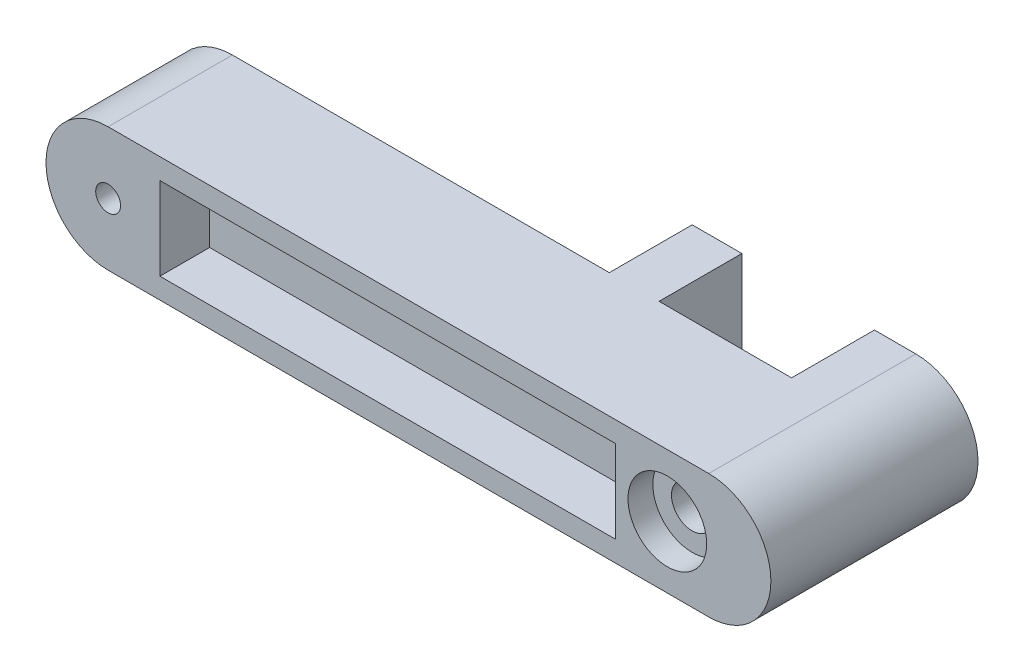
ISO-10303-21;
HEADER;
FILE_DESCRIPTION(('STEP AP214'),'2;1');
FILE_NAME('part.step','',(''),(''),'','','');
FILE_SCHEMA(('AUTOMOTIVE_DESIGN { 1 0 10303 214 1 1 1 1 }'));
ENDSEC;
DATA;
#1=APPLICATION_CONTEXT('core data for automotive mechanical design processes');
#2=APPLICATION_PROTOCOL_DEFINITION('international standard','automotive_design',2000,#1);
#3=PRODUCT_CONTEXT('',#1,'mechanical');
#4=PRODUCT('Part','Part','',(#3));
#5=PRODUCT_RELATED_PRODUCT_CATEGORY('part','',(#4));
#6=PRODUCT_DEFINITION_FORMATION('','',#4);
#7=PRODUCT_DEFINITION_CONTEXT('part definition',#1,'design');
#8=PRODUCT_DEFINITION('design','',#6,#7);
#9=PRODUCT_DEFINITION_SHAPE('','',#8);
#10=(LENGTH_UNIT() NAMED_UNIT(*) SI_UNIT(.MILLI.,.METRE.));
#11=(NAMED_UNIT(*) PLANE_ANGLE_UNIT() SI_UNIT($,.RADIAN.));
#12=(NAMED_UNIT(*) SI_UNIT($,.STERADIAN.) SOLID_ANGLE_UNIT());
#13=UNCERTAINTY_MEASURE_WITH_UNIT(LENGTH_MEASURE(1.E-05),#10,'distance_accuracy_value','');
#14=(GEOMETRIC_REPRESENTATION_CONTEXT(3) GLOBAL_UNCERTAINTY_ASSIGNED_CONTEXT((#13)) GLOBAL_UNIT_ASSIGNED_CONTEXT((#10,
#11,#12)) REPRESENTATION_CONTEXT('',''));
#15=CARTESIAN_POINT('',(0.,0.,0.));
#16=DIRECTION('',(0.,0.,1.));
#17=DIRECTION('',(1.,0.,0.));
#18=AXIS2_PLACEMENT_3D('',#15,#16,#17);
#19=CARTESIAN_POINT('',(1.11022302462516E-13,0.,-30.0000000000002));
#20=DIRECTION('',(0.,0.,-1.));
#21=DIRECTION('',(-1.,0.,0.));
#22=AXIS2_PLACEMENT_3D('',#19,#20,#21);
#23=PLANE('',#22);
#24=CARTESIAN_POINT('',(135.,0.,-29.9999999999998));
#25=DIRECTION('',(0.,0.,-1.));
#26=DIRECTION('',(-1.,0.,0.));
#27=AXIS2_PLACEMENT_3D('',#24,#25,#26);
#28=CIRCLE('',#27,9.50000000000001);
#29=CARTESIAN_POINT('',(125.5,0.,-29.9999999999998));
#30=VERTEX_POINT('',#29);
#31=EDGE_CURVE('E356',#30,#30,#28,.T.);
#32=ORIENTED_EDGE('',*,*,#31,.F.);
#33=EDGE_LOOP('',(#32));
#34=FACE_BOUND('',#33,.T.);
#35=CARTESIAN_POINT('',(135.,0.,-29.9999999999998));
#36=DIRECTION('',(0.,0.,1.));
#37=DIRECTION('',(-1.,0.,0.));
#38=AXIS2_PLACEMENT_3D('',#35,#36,#37);
#39=CIRCLE('',#38,15.);
#40=CARTESIAN_POINT('',(145.,11.1803398874989,-29.9999999999997));
#41=VERTEX_POINT('',#40);
#42=CARTESIAN_POINT('',(135.,15.,-29.9999999999998));
#43=VERTEX_POINT('',#42);
#44=EDGE_CURVE('E391',#41,#43,#39,.T.);
#45=ORIENTED_EDGE('',*,*,#44,.F.);
#46=DIRECTION('',(0.,-1.,0.));
#47=VECTOR('',#46,1.);
#48=CARTESIAN_POINT('',(145.,0.,-29.9999999999997));
#49=LINE('',#48,#47);
#50=CARTESIAN_POINT('',(145.,-11.1803398874989,-29.9999999999997));
#51=VERTEX_POINT('',#50);
#52=EDGE_CURVE('E248',#41,#51,#49,.T.);
#53=ORIENTED_EDGE('',*,*,#52,.T.);
#54=CARTESIAN_POINT('',(135.,-15.,-29.9999999999998));
#55=VERTEX_POINT('',#54);
#56=EDGE_CURVE('E392',#55,#51,#39,.T.);
#57=ORIENTED_EDGE('',*,*,#56,.F.);
#58=DIRECTION('',(1.,0.,0.));
#59=VECTOR('',#58,1.);
#60=CARTESIAN_POINT('',(135.,-15.,-29.9999999999998));
#61=LINE('',#60,#59);
#62=CARTESIAN_POINT('',(103.,-15.,-29.9999999999999));
#63=VERTEX_POINT('',#62);
#64=EDGE_CURVE('E388',#63,#55,#61,.T.);
#65=ORIENTED_EDGE('',*,*,#64,.F.);
#66=DIRECTION('',(0.,1.,0.));
#67=VECTOR('',#66,1.);
#68=CARTESIAN_POINT('',(103.,0.,-29.9999999999999));
#69=LINE('',#68,#67);
#70=CARTESIAN_POINT('',(103.,-9.99999999999999,-29.9999999999999));
#71=VERTEX_POINT('',#70);
#72=EDGE_CURVE('E279',#63,#71,#69,.T.);
#73=ORIENTED_EDGE('',*,*,#72,.T.);
#74=DIRECTION('',(-1.,0.,0.));
#75=VECTOR('',#74,1.);
#76=CARTESIAN_POINT('',(12.5000000000001,-9.99999999999999,-30.0000000000002));
#77=LINE('',#76,#75);
#78=CARTESIAN_POINT('',(122.5,-9.99999999999999,-29.9999999999998));
#79=VERTEX_POINT('',#78);
#80=EDGE_CURVE('E303',#79,#71,#77,.T.);
#81=ORIENTED_EDGE('',*,*,#80,.F.);
#82=DIRECTION('',(0.,-1.,0.));
#83=VECTOR('',#82,1.);
#84=CARTESIAN_POINT('',(122.5,-9.99999999999999,-29.9999999999998));
#85=LINE('',#84,#83);
#86=CARTESIAN_POINT('',(122.5,10.,-29.9999999999998));
#87=VERTEX_POINT('',#86);
#88=EDGE_CURVE('E61',#87,#79,#85,.T.);
#89=ORIENTED_EDGE('',*,*,#88,.F.);
#90=DIRECTION('',(1.,0.,0.));
#91=VECTOR('',#90,1.);
#92=CARTESIAN_POINT('',(12.5000000000001,10.,-30.0000000000002));
#93=LINE('',#92,#91);
#94=CARTESIAN_POINT('',(103.,10.,-29.9999999999999));
#95=VERTEX_POINT('',#94);
#96=EDGE_CURVE('E309',#95,#87,#93,.T.);
#97=ORIENTED_EDGE('',*,*,#96,.F.);
#98=CARTESIAN_POINT('',(103.,15.,-29.9999999999999));
#99=VERTEX_POINT('',#98);
#100=EDGE_CURVE('E283',#95,#99,#69,.T.);
#101=ORIENTED_EDGE('',*,*,#100,.T.);
#102=DIRECTION('',(-1.,0.,0.));
#103=VECTOR('',#102,1.);
#104=CARTESIAN_POINT('',(1.11022302462516E-13,15.,-30.0000000000002));
#105=LINE('',#104,#103);
#106=EDGE_CURVE('E381',#43,#99,#105,.T.);
#107=ORIENTED_EDGE('',*,*,#106,.F.);
#108=EDGE_LOOP('',(#45,#53,#57,#65,#73,#81,#89,#97,#101,#107));
#109=FACE_BOUND('',#108,.T.);
#110=ADVANCED_FACE('F38',(#34,#109),#23,.T.);
#111=CARTESIAN_POINT('',(1.11022302462516E-13,0.,-30.0000000000002));
#112=DIRECTION('',(0.,0.,1.));
#113=DIRECTION('',(1.,0.,0.));
#114=AXIS2_PLACEMENT_3D('',#111,#112,#113);
#115=CIRCLE('',#114,3.);
#116=CARTESIAN_POINT('',(3.00000000000011,0.,-30.0000000000002));
#117=VERTEX_POINT('',#116);
#118=EDGE_CURVE('E371',#117,#117,#115,.T.);
#119=ORIENTED_EDGE('',*,*,#118,.T.);
#120=EDGE_LOOP('',(#119));
#121=FACE_BOUND('',#120,.T.);
#122=CARTESIAN_POINT('',(91.0000000000001,15.,-29.9999999999999));
#123=VERTEX_POINT('',#122);
#124=CARTESIAN_POINT('',(1.11022302462516E-13,15.,-30.0000000000002));
#125=VERTEX_POINT('',#124);
#126=EDGE_CURVE('E395',#123,#125,#105,.T.);
#127=ORIENTED_EDGE('',*,*,#126,.F.);
#128=DIRECTION('',(0.,-1.,0.));
#129=VECTOR('',#128,1.);
#130=CARTESIAN_POINT('',(91.0000000000001,0.,-29.9999999999999));
#131=LINE('',#130,#129);
#132=CARTESIAN_POINT('',(91.0000000000001,10.,-29.9999999999999));
#133=VERTEX_POINT('',#132);
#134=EDGE_CURVE('E275',#123,#133,#131,.T.);
#135=ORIENTED_EDGE('',*,*,#134,.T.);
#136=CARTESIAN_POINT('',(12.5000000000001,10.,-30.0000000000002));
#137=VERTEX_POINT('',#136);
#138=EDGE_CURVE('E289',#137,#133,#93,.T.);
#139=ORIENTED_EDGE('',*,*,#138,.F.);
#140=DIRECTION('',(0.,1.,0.));
#141=VECTOR('',#140,1.);
#142=CARTESIAN_POINT('',(12.5000000000001,-9.99999999999999,-30.0000000000002));
#143=LINE('',#142,#141);
#144=CARTESIAN_POINT('',(12.5000000000001,-9.99999999999999,-30.0000000000002));
#145=VERTEX_POINT('',#144);
#146=EDGE_CURVE('E306',#145,#137,#143,.T.);
#147=ORIENTED_EDGE('',*,*,#146,.F.);
#148=CARTESIAN_POINT('',(91.0000000000001,-9.99999999999999,-29.9999999999999));
#149=VERTEX_POINT('',#148);
#150=EDGE_CURVE('E302',#149,#145,#77,.T.);
#151=ORIENTED_EDGE('',*,*,#150,.F.);
#152=CARTESIAN_POINT('',(91.0000000000001,-15.,-29.9999999999999));
#153=VERTEX_POINT('',#152);
#154=EDGE_CURVE('E271',#149,#153,#131,.T.);
#155=ORIENTED_EDGE('',*,*,#154,.T.);
#156=CARTESIAN_POINT('',(1.11022302462516E-13,-15.,-30.0000000000002));
#157=VERTEX_POINT('',#156);
#158=EDGE_CURVE('E389',#157,#153,#61,.T.);
#159=ORIENTED_EDGE('',*,*,#158,.F.);
#160=CARTESIAN_POINT('',(1.11022302462516E-13,0.,-30.0000000000002));
#161=DIRECTION('',(0.,0.,1.));
#162=DIRECTION('',(-1.,0.,0.));
#163=AXIS2_PLACEMENT_3D('',#160,#161,#162);
#164=CIRCLE('',#163,15.);
#165=EDGE_CURVE('E374',#125,#157,#164,.T.);
#166=ORIENTED_EDGE('',*,*,#165,.F.);
#167=EDGE_LOOP('',(#127,#135,#139,#147,#151,#155,#159,#166));
#168=FACE_BOUND('',#167,.T.);
#169=ADVANCED_FACE('F423',(#121,#168),#23,.T.);
#170=CARTESIAN_POINT('',(12.5000000000001,10.,-18.0000000000002));
#171=DIRECTION('',(0.,1.,0.));
#172=DIRECTION('',(-1.,0.,0.));
#173=AXIS2_PLACEMENT_3D('',#170,#171,#172);
#174=PLANE('',#173);
#175=DIRECTION('',(0.,0.,1.));
#176=VECTOR('',#175,1.);
#177=CARTESIAN_POINT('',(103.,10.,-17.9999999999999));
#178=LINE('',#177,#176);
#179=CARTESIAN_POINT('',(103.,10.,-17.9999999999999));
#180=VERTEX_POINT('',#179);
#181=EDGE_CURVE('E282',#95,#180,#178,.T.);
#182=ORIENTED_EDGE('',*,*,#181,.F.);
#183=ORIENTED_EDGE('',*,*,#96,.T.);
#184=DIRECTION('',(0.,0.,-1.));
#185=VECTOR('',#184,1.);
#186=CARTESIAN_POINT('',(122.5,10.,-17.9999999999998));
#187=LINE('',#186,#185);
#188=CARTESIAN_POINT('',(122.5,10.,-17.9999999999998));
#189=VERTEX_POINT('',#188);
#190=EDGE_CURVE('E312',#189,#87,#187,.T.);
#191=ORIENTED_EDGE('',*,*,#190,.F.);
#192=DIRECTION('',(1.,0.,0.));
#193=VECTOR('',#192,1.);
#194=CARTESIAN_POINT('',(12.5000000000001,10.,-18.0000000000002));
#195=LINE('',#194,#193);
#196=EDGE_CURVE('E296',#180,#189,#195,.T.);
#197=ORIENTED_EDGE('',*,*,#196,.F.);
#198=EDGE_LOOP('',(#182,#183,#191,#197));
#199=FACE_BOUND('',#198,.T.);
#200=ADVANCED_FACE('F469',(#199),#174,.F.);
#201=DIRECTION('',(0.,0.,-1.));
#202=VECTOR('',#201,1.);
#203=CARTESIAN_POINT('',(91.0000000000001,10.,-17.9999999999999));
#204=LINE('',#203,#202);
#205=CARTESIAN_POINT('',(91.0000000000001,10.,-17.9999999999999));
#206=VERTEX_POINT('',#205);
#207=EDGE_CURVE('E274',#206,#133,#204,.T.);
#208=ORIENTED_EDGE('',*,*,#207,.F.);
#209=CARTESIAN_POINT('',(12.5000000000001,10.,-18.0000000000002));
#210=VERTEX_POINT('',#209);
#211=EDGE_CURVE('E297',#210,#206,#195,.T.);
#212=ORIENTED_EDGE('',*,*,#211,.F.);
#213=DIRECTION('',(0.,0.,-1.));
#214=VECTOR('',#213,1.);
#215=CARTESIAN_POINT('',(12.5000000000001,10.,-18.0000000000002));
#216=LINE('',#215,#214);
#217=EDGE_CURVE('E315',#210,#137,#216,.T.);
#218=ORIENTED_EDGE('',*,*,#217,.T.);
#219=ORIENTED_EDGE('',*,*,#138,.T.);
#220=EDGE_LOOP('',(#208,#212,#218,#219));
#221=FACE_BOUND('',#220,.T.);
#222=ADVANCED_FACE('F416',(#221),#174,.F.);
#223=CARTESIAN_POINT('',(12.5000000000001,-9.99999999999999,-18.0000000000002));
#224=DIRECTION('',(0.,-1.,0.));
#225=DIRECTION('',(1.,0.,0.));
#226=AXIS2_PLACEMENT_3D('',#223,#224,#225);
#227=PLANE('',#226);
#228=DIRECTION('',(0.,0.,-1.));
#229=VECTOR('',#228,1.);
#230=CARTESIAN_POINT('',(103.,-9.99999999999999,-17.9999999999999));
#231=LINE('',#230,#229);
#232=CARTESIAN_POINT('',(103.,-9.99999999999999,-17.9999999999999));
#233=VERTEX_POINT('',#232);
#234=EDGE_CURVE('E277',#233,#71,#231,.T.);
#235=ORIENTED_EDGE('',*,*,#234,.F.);
#236=DIRECTION('',(-1.,0.,0.));
#237=VECTOR('',#236,1.);
#238=CARTESIAN_POINT('',(12.5000000000001,-9.99999999999999,-18.0000000000002));
#239=LINE('',#238,#237);
#240=CARTESIAN_POINT('',(122.5,-9.99999999999999,-17.9999999999998));
#241=VERTEX_POINT('',#240);
#242=EDGE_CURVE('E290',#241,#233,#239,.T.);
#243=ORIENTED_EDGE('',*,*,#242,.F.);
#244=DIRECTION('',(0.,0.,-1.));
#245=VECTOR('',#244,1.);
#246=CARTESIAN_POINT('',(122.5,-9.99999999999999,-17.9999999999998));
#247=LINE('',#246,#245);
#248=EDGE_CURVE('E300',#241,#79,#247,.T.);
#249=ORIENTED_EDGE('',*,*,#248,.T.);
#250=ORIENTED_EDGE('',*,*,#80,.T.);
#251=EDGE_LOOP('',(#235,#243,#249,#250));
#252=FACE_BOUND('',#251,.T.);
#253=ADVANCED_FACE('F459',(#252),#227,.F.);
#254=DIRECTION('',(0.,0.,1.));
#255=VECTOR('',#254,1.);
#256=CARTESIAN_POINT('',(91.0000000000001,-9.99999999999999,-17.9999999999999));
#257=LINE('',#256,#255);
#258=CARTESIAN_POINT('',(91.0000000000001,-9.99999999999999,-17.9999999999999));
#259=VERTEX_POINT('',#258);
#260=EDGE_CURVE('E53',#149,#259,#257,.T.);
#261=ORIENTED_EDGE('',*,*,#260,.F.);
#262=ORIENTED_EDGE('',*,*,#150,.T.);
#263=DIRECTION('',(0.,0.,-1.));
#264=VECTOR('',#263,1.);
#265=CARTESIAN_POINT('',(12.5000000000001,-9.99999999999999,-18.0000000000002));
#266=LINE('',#265,#264);
#267=CARTESIAN_POINT('',(12.5000000000001,-9.99999999999999,-18.0000000000002));
#268=VERTEX_POINT('',#267);
#269=EDGE_CURVE('E317',#268,#145,#266,.T.);
#270=ORIENTED_EDGE('',*,*,#269,.F.);
#271=EDGE_CURVE('E288',#259,#268,#239,.T.);
#272=ORIENTED_EDGE('',*,*,#271,.F.);
#273=EDGE_LOOP('',(#261,#262,#270,#272));
#274=FACE_BOUND('',#273,.T.);
#275=ADVANCED_FACE('F409',(#274),#227,.F.);
#276=CARTESIAN_POINT('',(0.,-15.,-18.0000000000002));
#277=DIRECTION('',(0.,0.,-1.));
#278=DIRECTION('',(-1.,0.,0.));
#279=AXIS2_PLACEMENT_3D('',#276,#277,#278);
#280=PLANE('',#279);
#281=ORIENTED_EDGE('',*,*,#242,.T.);
#282=DIRECTION('',(0.,1.,0.));
#283=VECTOR('',#282,1.);
#284=CARTESIAN_POINT('',(103.,-15.,-17.9999999999999));
#285=LINE('',#284,#283);
#286=EDGE_CURVE('E11',#233,#180,#285,.T.);
#287=ORIENTED_EDGE('',*,*,#286,.T.);
#288=ORIENTED_EDGE('',*,*,#196,.T.);
#289=DIRECTION('',(0.,-1.,0.));
#290=VECTOR('',#289,1.);
#291=CARTESIAN_POINT('',(122.5,-9.99999999999999,-17.9999999999998));
#292=LINE('',#291,#290);
#293=EDGE_CURVE('E285',#189,#241,#292,.T.);
#294=ORIENTED_EDGE('',*,*,#293,.T.);
#295=EDGE_LOOP('',(#281,#287,#288,#294));
#296=FACE_BOUND('',#295,.T.);
#297=ADVANCED_FACE('F461',(#296),#280,.T.);
#298=ORIENTED_EDGE('',*,*,#211,.T.);
#299=DIRECTION('',(0.,-1.,0.));
#300=VECTOR('',#299,1.);
#301=CARTESIAN_POINT('',(91.0000000000001,-15.,-17.9999999999999));
#302=LINE('',#301,#300);
#303=EDGE_CURVE('E46',#206,#259,#302,.T.);
#304=ORIENTED_EDGE('',*,*,#303,.T.);
#305=ORIENTED_EDGE('',*,*,#271,.T.);
#306=DIRECTION('',(0.,1.,0.));
#307=VECTOR('',#306,1.);
#308=CARTESIAN_POINT('',(12.5000000000001,-9.99999999999999,-18.0000000000002));
#309=LINE('',#308,#307);
#310=EDGE_CURVE('E293',#268,#210,#309,.T.);
#311=ORIENTED_EDGE('',*,*,#310,.T.);
#312=EDGE_LOOP('',(#298,#304,#305,#311));
#313=FACE_BOUND('',#312,.T.);
#314=ADVANCED_FACE('F404',(#313),#280,.T.);
#315=CARTESIAN_POINT('',(0.,0.,-2.28983498828939E-13));
#316=DIRECTION('',(0.,0.,-1.));
#317=DIRECTION('',(-1.,0.,0.));
#318=AXIS2_PLACEMENT_3D('',#315,#316,#317);
#319=CYLINDRICAL_SURFACE('',#318,15.);
#320=ORIENTED_EDGE('',*,*,#165,.T.);
#321=DIRECTION('',(0.,0.,-1.));
#322=VECTOR('',#321,1.);
#323=CARTESIAN_POINT('',(0.,-15.,-2.28983498828939E-13));
#324=LINE('',#323,#322);
#325=CARTESIAN_POINT('',(0.,-15.,-2.28983498828939E-13));
#326=VERTEX_POINT('',#325);
#327=EDGE_CURVE('E400',#326,#157,#324,.T.);
#328=ORIENTED_EDGE('',*,*,#327,.F.);
#329=CARTESIAN_POINT('',(0.,0.,-2.28983498828939E-13));
#330=DIRECTION('',(0.,0.,1.));
#331=DIRECTION('',(-1.,0.,0.));
#332=AXIS2_PLACEMENT_3D('',#329,#330,#331);
#333=CIRCLE('',#332,15.);
#334=CARTESIAN_POINT('',(0.,15.,-2.28983498828939E-13));
#335=VERTEX_POINT('',#334);
#336=EDGE_CURVE('E377',#335,#326,#333,.T.);
#337=ORIENTED_EDGE('',*,*,#336,.F.);
#338=DIRECTION('',(0.,0.,-1.));
#339=VECTOR('',#338,1.);
#340=CARTESIAN_POINT('',(0.,15.,-2.28983498828939E-13));
#341=LINE('',#340,#339);
#342=EDGE_CURVE('E385',#335,#125,#341,.T.);
#343=ORIENTED_EDGE('',*,*,#342,.T.);
#344=EDGE_LOOP('',(#320,#328,#337,#343));
#345=FACE_BOUND('',#344,.T.);
#346=ADVANCED_FACE('F40',(#345),#319,.T.);
#347=CARTESIAN_POINT('',(135.,-15.,2.35922392732846E-13));
#348=DIRECTION('',(0.,1.,0.));
#349=DIRECTION('',(-1.,0.,0.));
#350=AXIS2_PLACEMENT_3D('',#347,#348,#349);
#351=PLANE('',#350);
#352=ORIENTED_EDGE('',*,*,#158,.T.);
#353=DIRECTION('',(0.,0.,1.));
#354=VECTOR('',#353,1.);
#355=CARTESIAN_POINT('',(91.0000000000002,-15.,-49.9999999999999));
#356=LINE('',#355,#354);
#357=CARTESIAN_POINT('',(91.0000000000002,-15.,-49.9999999999999));
#358=VERTEX_POINT('',#357);
#359=EDGE_CURVE('E265',#358,#153,#356,.T.);
#360=ORIENTED_EDGE('',*,*,#359,.F.);
#361=DIRECTION('',(-1.,0.,0.));
#362=VECTOR('',#361,1.);
#363=CARTESIAN_POINT('',(103.,-15.,-49.9999999999999));
#364=LINE('',#363,#362);
#365=CARTESIAN_POINT('',(103.,-15.,-49.9999999999999));
#366=VERTEX_POINT('',#365);
#367=EDGE_CURVE('E254',#366,#358,#364,.T.);
#368=ORIENTED_EDGE('',*,*,#367,.F.);
#369=DIRECTION('',(0.,0.,1.));
#370=VECTOR('',#369,1.);
#371=CARTESIAN_POINT('',(103.,-15.,-49.9999999999999));
#372=LINE('',#371,#370);
#373=EDGE_CURVE('E267',#366,#63,#372,.T.);
#374=ORIENTED_EDGE('',*,*,#373,.T.);
#375=ORIENTED_EDGE('',*,*,#64,.T.);
#376=DIRECTION('',(0.,0.,1.));
#377=VECTOR('',#376,1.);
#378=CARTESIAN_POINT('',(135.,-15.,-89.0512483795331));
#379=LINE('',#378,#377);
#380=CARTESIAN_POINT('',(135.,-15.,-49.9999999999998));
#381=VERTEX_POINT('',#380);
#382=EDGE_CURVE('E225',#381,#55,#379,.T.);
#383=ORIENTED_EDGE('',*,*,#382,.F.);
#384=DIRECTION('',(1.,0.,0.));
#385=VECTOR('',#384,1.);
#386=CARTESIAN_POINT('',(145.,-15.,-49.9999999999997));
#387=LINE('',#386,#385);
#388=CARTESIAN_POINT('',(145.,-15.,-49.9999999999997));
#389=VERTEX_POINT('',#388);
#390=EDGE_CURVE('E205',#381,#389,#387,.T.);
#391=ORIENTED_EDGE('',*,*,#390,.T.);
#392=DIRECTION('',(0.,0.,1.));
#393=VECTOR('',#392,1.);
#394=CARTESIAN_POINT('',(145.,-15.,-89.0512483795331));
#395=LINE('',#394,#393);
#396=CARTESIAN_POINT('',(145.,-15.,2.70616862252382E-13));
#397=VERTEX_POINT('',#396);
#398=EDGE_CURVE('E213',#389,#397,#395,.T.);
#399=ORIENTED_EDGE('',*,*,#398,.T.);
#400=DIRECTION('',(1.,0.,0.));
#401=VECTOR('',#400,1.);
#402=CARTESIAN_POINT('',(135.,-15.,2.35922392732846E-13));
#403=LINE('',#402,#401);
#404=EDGE_CURVE('E380',#326,#397,#403,.T.);
#405=ORIENTED_EDGE('',*,*,#404,.F.);
#406=ORIENTED_EDGE('',*,*,#327,.T.);
#407=EDGE_LOOP('',(#352,#360,#368,#374,#375,#383,#391,#399,#405,#406));
#408=FACE_BOUND('',#407,.T.);
#409=ADVANCED_FACE('F223',(#408),#351,.F.);
#410=CARTESIAN_POINT('',(0.,15.,-2.28983498828939E-13));
#411=DIRECTION('',(0.,-1.,0.));
#412=DIRECTION('',(1.,0.,0.));
#413=AXIS2_PLACEMENT_3D('',#410,#411,#412);
#414=PLANE('',#413);
#415=ORIENTED_EDGE('',*,*,#106,.T.);
#416=DIRECTION('',(0.,0.,1.));
#417=VECTOR('',#416,1.);
#418=CARTESIAN_POINT('',(103.,15.,-49.9999999999999));
#419=LINE('',#418,#417);
#420=CARTESIAN_POINT('',(103.,15.,-49.9999999999999));
#421=VERTEX_POINT('',#420);
#422=EDGE_CURVE('E260',#421,#99,#419,.T.);
#423=ORIENTED_EDGE('',*,*,#422,.F.);
#424=DIRECTION('',(1.,0.,0.));
#425=VECTOR('',#424,1.);
#426=CARTESIAN_POINT('',(103.,15.,-49.9999999999999));
#427=LINE('',#426,#425);
#428=CARTESIAN_POINT('',(91.0000000000002,15.,-49.9999999999999));
#429=VERTEX_POINT('',#428);
#430=EDGE_CURVE('E258',#429,#421,#427,.T.);
#431=ORIENTED_EDGE('',*,*,#430,.F.);
#432=DIRECTION('',(0.,0.,1.));
#433=VECTOR('',#432,1.);
#434=CARTESIAN_POINT('',(91.0000000000002,15.,-49.9999999999999));
#435=LINE('',#434,#433);
#436=EDGE_CURVE('E262',#429,#123,#435,.T.);
#437=ORIENTED_EDGE('',*,*,#436,.T.);
#438=ORIENTED_EDGE('',*,*,#126,.T.);
#439=ORIENTED_EDGE('',*,*,#342,.F.);
#440=DIRECTION('',(-1.,0.,0.));
#441=VECTOR('',#440,1.);
#442=CARTESIAN_POINT('',(0.,15.,-2.28983498828939E-13));
#443=LINE('',#442,#441);
#444=CARTESIAN_POINT('',(145.,15.,2.70616862252382E-13));
#445=VERTEX_POINT('',#444);
#446=EDGE_CURVE('E383',#445,#335,#443,.T.);
#447=ORIENTED_EDGE('',*,*,#446,.F.);
#448=DIRECTION('',(0.,0.,1.));
#449=VECTOR('',#448,1.);
#450=CARTESIAN_POINT('',(145.,15.,-89.0512483795331));
#451=LINE('',#450,#449);
#452=CARTESIAN_POINT('',(145.,15.,-49.9999999999997));
#453=VERTEX_POINT('',#452);
#454=EDGE_CURVE('E212',#453,#445,#451,.T.);
#455=ORIENTED_EDGE('',*,*,#454,.F.);
#456=DIRECTION('',(-1.,0.,0.));
#457=VECTOR('',#456,1.);
#458=CARTESIAN_POINT('',(135.,15.,-49.9999999999998));
#459=LINE('',#458,#457);
#460=CARTESIAN_POINT('',(135.,15.,-49.9999999999998));
#461=VERTEX_POINT('',#460);
#462=EDGE_CURVE('E208',#453,#461,#459,.T.);
#463=ORIENTED_EDGE('',*,*,#462,.T.);
#464=DIRECTION('',(0.,0.,1.));
#465=VECTOR('',#464,1.);
#466=CARTESIAN_POINT('',(135.,15.,-89.0512483795331));
#467=LINE('',#466,#465);
#468=EDGE_CURVE('E235',#461,#43,#467,.T.);
#469=ORIENTED_EDGE('',*,*,#468,.T.);
#470=EDGE_LOOP('',(#415,#423,#431,#437,#438,#439,#447,#455,#463,#469));
#471=FACE_BOUND('',#470,.T.);
#472=ADVANCED_FACE('F427',(#471),#414,.F.);
#473=CARTESIAN_POINT('',(0.,0.,-2.28983498828939E-13));
#474=DIRECTION('',(0.,0.,-1.));
#475=DIRECTION('',(-1.,0.,0.));
#476=AXIS2_PLACEMENT_3D('',#473,#474,#475);
#477=PLANE('',#476);
#478=DIRECTION('',(-1.,0.,0.));
#479=VECTOR('',#478,1.);
#480=CARTESIAN_POINT('',(12.5,10.,-1.87350135405495E-13));
#481=LINE('',#480,#479);
#482=CARTESIAN_POINT('',(122.5,10.,1.94289029309402E-13));
#483=VERTEX_POINT('',#482);
#484=CARTESIAN_POINT('',(12.5,10.,-1.87350135405495E-13));
#485=VERTEX_POINT('',#484);
#486=EDGE_CURVE('E336',#483,#485,#481,.T.);
#487=ORIENTED_EDGE('',*,*,#486,.F.);
#488=DIRECTION('',(0.,1.,0.));
#489=VECTOR('',#488,1.);
#490=CARTESIAN_POINT('',(122.5,10.,1.94289029309402E-13));
#491=LINE('',#490,#489);
#492=CARTESIAN_POINT('',(122.5,-9.99999999999999,1.94289029309402E-13));
#493=VERTEX_POINT('',#492);
#494=EDGE_CURVE('E314',#493,#483,#491,.T.);
#495=ORIENTED_EDGE('',*,*,#494,.F.);
#496=DIRECTION('',(1.,0.,0.));
#497=VECTOR('',#496,1.);
#498=CARTESIAN_POINT('',(12.5,-9.99999999999999,-1.87350135405495E-13));
#499=LINE('',#498,#497);
#500=CARTESIAN_POINT('',(12.5,-9.99999999999999,-1.87350135405495E-13));
#501=VERTEX_POINT('',#500);
#502=EDGE_CURVE('E325',#501,#493,#499,.T.);
#503=ORIENTED_EDGE('',*,*,#502,.F.);
#504=DIRECTION('',(0.,-1.,0.));
#505=VECTOR('',#504,1.);
#506=CARTESIAN_POINT('',(12.5,10.,-1.87350135405495E-13));
#507=LINE('',#506,#505);
#508=EDGE_CURVE('E339',#485,#501,#507,.T.);
#509=ORIENTED_EDGE('',*,*,#508,.F.);
#510=EDGE_LOOP('',(#487,#495,#503,#509));
#511=FACE_BOUND('',#510,.T.);
#512=CARTESIAN_POINT('',(135.,0.,2.35922392732846E-13));
#513=DIRECTION('',(0.,0.,1.));
#514=DIRECTION('',(1.,0.,0.));
#515=AXIS2_PLACEMENT_3D('',#512,#513,#514);
#516=CIRCLE('',#515,9.50000000000001);
#517=CARTESIAN_POINT('',(144.5,0.,2.68618460808057E-13));
#518=VERTEX_POINT('',#517);
#519=EDGE_CURVE('E362',#518,#518,#516,.T.);
#520=ORIENTED_EDGE('',*,*,#519,.F.);
#521=EDGE_LOOP('',(#520));
#522=FACE_BOUND('',#521,.T.);
#523=CARTESIAN_POINT('',(0.,0.,-2.28983498828939E-13));
#524=DIRECTION('',(0.,0.,1.));
#525=DIRECTION('',(1.,0.,0.));
#526=AXIS2_PLACEMENT_3D('',#523,#524,#525);
#527=CIRCLE('',#526,3.);
#528=CARTESIAN_POINT('',(3.,0.,-2.18658424699925E-13));
#529=VERTEX_POINT('',#528);
#530=EDGE_CURVE('E368',#529,#529,#527,.T.);
#531=ORIENTED_EDGE('',*,*,#530,.F.);
#532=EDGE_LOOP('',(#531));
#533=FACE_BOUND('',#532,.T.);
#534=ORIENTED_EDGE('',*,*,#336,.T.);
#535=ORIENTED_EDGE('',*,*,#404,.T.);
#536=CARTESIAN_POINT('',(145.,0.,2.70616862252382E-13));
#537=DIRECTION('',(0.,0.,1.));
#538=DIRECTION('',(-1.,0.,0.));
#539=AXIS2_PLACEMENT_3D('',#536,#537,#538);
#540=CIRCLE('',#539,15.);
#541=EDGE_CURVE('E219',#397,#445,#540,.T.);
#542=ORIENTED_EDGE('',*,*,#541,.T.);
#543=ORIENTED_EDGE('',*,*,#446,.T.);
#544=EDGE_LOOP('',(#534,#535,#542,#543));
#545=FACE_BOUND('',#544,.T.);
#546=ADVANCED_FACE('F433',(#511,#522,#533,#545),#477,.F.);
#547=CARTESIAN_POINT('',(1.11022302462516E-13,0.,-30.0000000000002));
#548=DIRECTION('',(0.,0.,1.));
#549=DIRECTION('',(1.,0.,0.));
#550=AXIS2_PLACEMENT_3D('',#547,#548,#549);
#551=CYLINDRICAL_SURFACE('',#550,3.);
#552=ORIENTED_EDGE('',*,*,#118,.F.);
#553=EDGE_LOOP('',(#552));
#554=FACE_BOUND('',#553,.T.);
#555=ORIENTED_EDGE('',*,*,#530,.T.);
#556=EDGE_LOOP('',(#555));
#557=FACE_BOUND('',#556,.T.);
#558=ADVANCED_FACE('F555',(#554,#557),#551,.F.);
#559=CARTESIAN_POINT('',(135.,0.,-5.99999999999976));
#560=DIRECTION('',(0.,0.,1.));
#561=DIRECTION('',(1.,0.,0.));
#562=AXIS2_PLACEMENT_3D('',#559,#560,#561);
#563=CYLINDRICAL_SURFACE('',#562,9.50000000000001);
#564=CARTESIAN_POINT('',(135.,0.,-5.99999999999976));
#565=DIRECTION('',(0.,0.,1.));
#566=DIRECTION('',(1.,0.,0.));
#567=AXIS2_PLACEMENT_3D('',#564,#565,#566);
#568=CIRCLE('',#567,9.50000000000001);
#569=CARTESIAN_POINT('',(144.5,0.,-5.99999999999973));
#570=VERTEX_POINT('',#569);
#571=EDGE_CURVE('E365',#570,#570,#568,.T.);
#572=ORIENTED_EDGE('',*,*,#571,.F.);
#573=EDGE_LOOP('',(#572));
#574=FACE_BOUND('',#573,.T.);
#575=ORIENTED_EDGE('',*,*,#519,.T.);
#576=EDGE_LOOP('',(#575));
#577=FACE_BOUND('',#576,.T.);
#578=ADVANCED_FACE('F552',(#574,#577),#563,.F.);
#579=CARTESIAN_POINT('',(135.,0.,-5.99999999999976));
#580=DIRECTION('',(0.,0.,1.));
#581=DIRECTION('',(1.,0.,0.));
#582=AXIS2_PLACEMENT_3D('',#579,#580,#581);
#583=PLANE('',#582);
#584=CARTESIAN_POINT('',(135.,0.,-5.99999999999976));
#585=DIRECTION('',(0.,0.,1.));
#586=DIRECTION('',(1.,0.,0.));
#587=AXIS2_PLACEMENT_3D('',#584,#585,#586);
#588=CIRCLE('',#587,4.99999999999999);
#589=CARTESIAN_POINT('',(140.,0.,-5.99999999999975));
#590=VERTEX_POINT('',#589);
#591=EDGE_CURVE('E346',#590,#590,#588,.F.);
#592=ORIENTED_EDGE('',*,*,#591,.T.);
#593=EDGE_LOOP('',(#592));
#594=FACE_BOUND('',#593,.T.);
#595=ORIENTED_EDGE('',*,*,#571,.T.);
#596=EDGE_LOOP('',(#595));
#597=FACE_BOUND('',#596,.T.);
#598=ADVANCED_FACE('F548',(#594,#597),#583,.T.);
#599=CARTESIAN_POINT('',(135.,0.,-23.9999999999998));
#600=DIRECTION('',(0.,0.,-1.));
#601=DIRECTION('',(-1.,0.,0.));
#602=AXIS2_PLACEMENT_3D('',#599,#600,#601);
#603=CYLINDRICAL_SURFACE('',#602,9.50000000000001);
#604=CARTESIAN_POINT('',(135.,0.,-23.9999999999998));
#605=DIRECTION('',(0.,0.,-1.));
#606=DIRECTION('',(-1.,0.,0.));
#607=AXIS2_PLACEMENT_3D('',#604,#605,#606);
#608=CIRCLE('',#607,9.50000000000001);
#609=CARTESIAN_POINT('',(125.5,0.,-23.9999999999998));
#610=VERTEX_POINT('',#609);
#611=EDGE_CURVE('E359',#610,#610,#608,.T.);
#612=ORIENTED_EDGE('',*,*,#611,.F.);
#613=EDGE_LOOP('',(#612));
#614=FACE_BOUND('',#613,.T.);
#615=ORIENTED_EDGE('',*,*,#31,.T.);
#616=EDGE_LOOP('',(#615));
#617=FACE_BOUND('',#616,.T.);
#618=ADVANCED_FACE('F544',(#614,#617),#603,.F.);
#619=CARTESIAN_POINT('',(135.,0.,-23.9999999999998));
#620=DIRECTION('',(0.,0.,-1.));
#621=DIRECTION('',(-1.,0.,0.));
#622=AXIS2_PLACEMENT_3D('',#619,#620,#621);
#623=PLANE('',#622);
#624=CARTESIAN_POINT('',(135.,0.,-23.9999999999998));
#625=DIRECTION('',(0.,0.,-1.));
#626=DIRECTION('',(-1.,0.,0.));
#627=AXIS2_PLACEMENT_3D('',#624,#625,#626);
#628=CIRCLE('',#627,4.99999999999999);
#629=CARTESIAN_POINT('',(130.,0.,-23.9999999999998));
#630=VERTEX_POINT('',#629);
#631=EDGE_CURVE('E353',#630,#630,#628,.T.);
#632=ORIENTED_EDGE('',*,*,#631,.F.);
#633=EDGE_LOOP('',(#632));
#634=FACE_BOUND('',#633,.T.);
#635=ORIENTED_EDGE('',*,*,#611,.T.);
#636=EDGE_LOOP('',(#635));
#637=FACE_BOUND('',#636,.T.);
#638=ADVANCED_FACE('F540',(#634,#637),#623,.T.);
#639=CARTESIAN_POINT('',(135.,0.,0.00100000000023692));
#640=DIRECTION('',(0.,0.,-1.));
#641=DIRECTION('',(-1.,0.,0.));
#642=AXIS2_PLACEMENT_3D('',#639,#640,#641);
#643=CYLINDRICAL_SURFACE('',#642,4.99999999999999);
#644=ORIENTED_EDGE('',*,*,#591,.F.);
#645=EDGE_LOOP('',(#644));
#646=FACE_BOUND('',#645,.T.);
#647=ORIENTED_EDGE('',*,*,#631,.T.);
#648=EDGE_LOOP('',(#647));
#649=FACE_BOUND('',#648,.T.);
#650=ADVANCED_FACE('F536',(#646,#649),#643,.F.);
#651=CARTESIAN_POINT('',(122.5,10.,-11.9999999999998));
#652=DIRECTION('',(1.,0.,0.));
#653=DIRECTION('',(0.,0.,-1.));
#654=AXIS2_PLACEMENT_3D('',#651,#652,#653);
#655=PLANE('',#654);
#656=ORIENTED_EDGE('',*,*,#494,.T.);
#657=DIRECTION('',(0.,0.,1.));
#658=VECTOR('',#657,1.);
#659=CARTESIAN_POINT('',(122.5,10.,-11.9999999999998));
#660=LINE('',#659,#658);
#661=CARTESIAN_POINT('',(122.5,10.,-11.9999999999998));
#662=VERTEX_POINT('',#661);
#663=EDGE_CURVE('E334',#662,#483,#660,.T.);
#664=ORIENTED_EDGE('',*,*,#663,.F.);
#665=DIRECTION('',(0.,1.,0.));
#666=VECTOR('',#665,1.);
#667=CARTESIAN_POINT('',(122.5,10.,-11.9999999999998));
#668=LINE('',#667,#666);
#669=CARTESIAN_POINT('',(122.5,-9.99999999999999,-11.9999999999998));
#670=VERTEX_POINT('',#669);
#671=EDGE_CURVE('E321',#670,#662,#668,.T.);
#672=ORIENTED_EDGE('',*,*,#671,.F.);
#673=DIRECTION('',(0.,0.,1.));
#674=VECTOR('',#673,1.);
#675=CARTESIAN_POINT('',(122.5,-9.99999999999999,-11.9999999999998));
#676=LINE('',#675,#674);
#677=EDGE_CURVE('E344',#670,#493,#676,.T.);
#678=ORIENTED_EDGE('',*,*,#677,.T.);
#679=EDGE_LOOP('',(#656,#664,#672,#678));
#680=FACE_BOUND('',#679,.T.);
#681=ADVANCED_FACE('F526',(#680),#655,.F.);
#682=CARTESIAN_POINT('',(12.5000000000001,-9.99999999999999,-12.0000000000002));
#683=DIRECTION('',(0.,-1.,0.));
#684=DIRECTION('',(1.,0.,0.));
#685=AXIS2_PLACEMENT_3D('',#682,#683,#684);
#686=PLANE('',#685);
#687=ORIENTED_EDGE('',*,*,#502,.T.);
#688=ORIENTED_EDGE('',*,*,#677,.F.);
#689=DIRECTION('',(1.,0.,0.));
#690=VECTOR('',#689,1.);
#691=CARTESIAN_POINT('',(12.5000000000001,-9.99999999999999,-12.0000000000002));
#692=LINE('',#691,#690);
#693=CARTESIAN_POINT('',(12.5000000000001,-9.99999999999999,-12.0000000000002));
#694=VERTEX_POINT('',#693);
#695=EDGE_CURVE('E331',#694,#670,#692,.T.);
#696=ORIENTED_EDGE('',*,*,#695,.F.);
#697=DIRECTION('',(0.,0.,1.));
#698=VECTOR('',#697,1.);
#699=CARTESIAN_POINT('',(12.5000000000001,-9.99999999999999,-12.0000000000002));
#700=LINE('',#699,#698);
#701=EDGE_CURVE('E347',#694,#501,#700,.T.);
#702=ORIENTED_EDGE('',*,*,#701,.T.);
#703=EDGE_LOOP('',(#687,#688,#696,#702));
#704=FACE_BOUND('',#703,.T.);
#705=ADVANCED_FACE('F522',(#704),#686,.F.);
#706=CARTESIAN_POINT('',(12.5000000000001,10.,-12.0000000000002));
#707=DIRECTION('',(-1.,0.,0.));
#708=DIRECTION('',(0.,0.,1.));
#709=AXIS2_PLACEMENT_3D('',#706,#707,#708);
#710=PLANE('',#709);
#711=ORIENTED_EDGE('',*,*,#508,.T.);
#712=ORIENTED_EDGE('',*,*,#701,.F.);
#713=DIRECTION('',(0.,-1.,0.));
#714=VECTOR('',#713,1.);
#715=CARTESIAN_POINT('',(12.5000000000001,10.,-12.0000000000002));
#716=LINE('',#715,#714);
#717=CARTESIAN_POINT('',(12.5000000000001,10.,-12.0000000000002));
#718=VERTEX_POINT('',#717);
#719=EDGE_CURVE('E328',#718,#694,#716,.T.);
#720=ORIENTED_EDGE('',*,*,#719,.F.);
#721=DIRECTION('',(0.,0.,1.));
#722=VECTOR('',#721,1.);
#723=CARTESIAN_POINT('',(12.5000000000001,10.,-12.0000000000002));
#724=LINE('',#723,#722);
#725=EDGE_CURVE('E349',#718,#485,#724,.T.);
#726=ORIENTED_EDGE('',*,*,#725,.T.);
#727=EDGE_LOOP('',(#711,#712,#720,#726));
#728=FACE_BOUND('',#727,.T.);
#729=ADVANCED_FACE('F525',(#728),#710,.F.);
#730=CARTESIAN_POINT('',(12.5000000000001,10.,-12.0000000000002));
#731=DIRECTION('',(0.,1.,0.));
#732=DIRECTION('',(-1.,0.,0.));
#733=AXIS2_PLACEMENT_3D('',#730,#731,#732);
#734=PLANE('',#733);
#735=ORIENTED_EDGE('',*,*,#486,.T.);
#736=ORIENTED_EDGE('',*,*,#725,.F.);
#737=DIRECTION('',(-1.,0.,0.));
#738=VECTOR('',#737,1.);
#739=CARTESIAN_POINT('',(12.5000000000001,10.,-12.0000000000002));
#740=LINE('',#739,#738);
#741=EDGE_CURVE('E324',#662,#718,#740,.T.);
#742=ORIENTED_EDGE('',*,*,#741,.F.);
#743=ORIENTED_EDGE('',*,*,#663,.T.);
#744=EDGE_LOOP('',(#735,#736,#742,#743));
#745=FACE_BOUND('',#744,.T.);
#746=ADVANCED_FACE('F520',(#745),#734,.F.);
#747=CARTESIAN_POINT('',(0.,-15.,-12.0000000000002));
#748=DIRECTION('',(0.,0.,1.));
#749=DIRECTION('',(1.,0.,0.));
#750=AXIS2_PLACEMENT_3D('',#747,#748,#749);
#751=PLANE('',#750);
#752=ORIENTED_EDGE('',*,*,#671,.T.);
#753=ORIENTED_EDGE('',*,*,#741,.T.);
#754=ORIENTED_EDGE('',*,*,#719,.T.);
#755=ORIENTED_EDGE('',*,*,#695,.T.);
#756=EDGE_LOOP('',(#752,#753,#754,#755));
#757=FACE_BOUND('',#756,.T.);
#758=ADVANCED_FACE('F517',(#757),#751,.T.);
#759=CARTESIAN_POINT('',(122.5,-9.99999999999999,-17.9999999999998));
#760=DIRECTION('',(1.,0.,0.));
#761=DIRECTION('',(0.,0.,-1.));
#762=AXIS2_PLACEMENT_3D('',#759,#760,#761);
#763=PLANE('',#762);
#764=ORIENTED_EDGE('',*,*,#88,.T.);
#765=ORIENTED_EDGE('',*,*,#248,.F.);
#766=ORIENTED_EDGE('',*,*,#293,.F.);
#767=ORIENTED_EDGE('',*,*,#190,.T.);
#768=EDGE_LOOP('',(#764,#765,#766,#767));
#769=FACE_BOUND('',#768,.T.);
#770=ADVANCED_FACE('F465',(#769),#763,.F.);
#771=CARTESIAN_POINT('',(12.5000000000001,-9.99999999999999,-18.0000000000002));
#772=DIRECTION('',(-1.,0.,0.));
#773=DIRECTION('',(0.,0.,1.));
#774=AXIS2_PLACEMENT_3D('',#771,#772,#773);
#775=PLANE('',#774);
#776=ORIENTED_EDGE('',*,*,#146,.T.);
#777=ORIENTED_EDGE('',*,*,#217,.F.);
#778=ORIENTED_EDGE('',*,*,#310,.F.);
#779=ORIENTED_EDGE('',*,*,#269,.T.);
#780=EDGE_LOOP('',(#776,#777,#778,#779));
#781=FACE_BOUND('',#780,.T.);
#782=ADVANCED_FACE('F414',(#781),#775,.F.);
#783=CARTESIAN_POINT('',(103.,15.,-49.9999999999999));
#784=DIRECTION('',(-1.,0.,0.));
#785=DIRECTION('',(0.,0.,1.));
#786=AXIS2_PLACEMENT_3D('',#783,#784,#785);
#787=PLANE('',#786);
#788=ORIENTED_EDGE('',*,*,#100,.F.);
#789=ORIENTED_EDGE('',*,*,#181,.T.);
#790=ORIENTED_EDGE('',*,*,#286,.F.);
#791=ORIENTED_EDGE('',*,*,#234,.T.);
#792=ORIENTED_EDGE('',*,*,#72,.F.);
#793=ORIENTED_EDGE('',*,*,#373,.F.);
#794=DIRECTION('',(0.,-1.,0.));
#795=VECTOR('',#794,1.);
#796=CARTESIAN_POINT('',(103.,15.,-49.9999999999999));
#797=LINE('',#796,#795);
#798=EDGE_CURVE('E251',#421,#366,#797,.T.);
#799=ORIENTED_EDGE('',*,*,#798,.F.);
#800=ORIENTED_EDGE('',*,*,#422,.T.);
#801=EDGE_LOOP('',(#788,#789,#790,#791,#792,#793,#799,#800));
#802=FACE_BOUND('',#801,.T.);
#803=ADVANCED_FACE('F455',(#802),#787,.F.);
#804=CARTESIAN_POINT('',(91.0000000000002,15.,-49.9999999999999));
#805=DIRECTION('',(1.,0.,0.));
#806=DIRECTION('',(0.,0.,-1.));
#807=AXIS2_PLACEMENT_3D('',#804,#805,#806);
#808=PLANE('',#807);
#809=ORIENTED_EDGE('',*,*,#134,.F.);
#810=ORIENTED_EDGE('',*,*,#436,.F.);
#811=DIRECTION('',(0.,1.,0.));
#812=VECTOR('',#811,1.);
#813=CARTESIAN_POINT('',(91.0000000000002,15.,-49.9999999999999));
#814=LINE('',#813,#812);
#815=EDGE_CURVE('E256',#358,#429,#814,.T.);
#816=ORIENTED_EDGE('',*,*,#815,.F.);
#817=ORIENTED_EDGE('',*,*,#359,.T.);
#818=ORIENTED_EDGE('',*,*,#154,.F.);
#819=ORIENTED_EDGE('',*,*,#260,.T.);
#820=ORIENTED_EDGE('',*,*,#303,.F.);
#821=ORIENTED_EDGE('',*,*,#207,.T.);
#822=EDGE_LOOP('',(#809,#810,#816,#817,#818,#819,#820,#821));
#823=FACE_BOUND('',#822,.T.);
#824=ADVANCED_FACE('F419',(#823),#808,.F.);
#825=CARTESIAN_POINT('',(1.80411241501588E-13,-15.,-50.0000000000002));
#826=DIRECTION('',(0.,0.,-1.));
#827=DIRECTION('',(-1.,0.,0.));
#828=AXIS2_PLACEMENT_3D('',#825,#826,#827);
#829=PLANE('',#828);
#830=CARTESIAN_POINT('',(99.3500000000002,-4.64981001313187,-49.9999999999999));
#831=DIRECTION('',(0.,0.,-1.));
#832=DIRECTION('',(-1.,0.,0.));
#833=AXIS2_PLACEMENT_3D('',#830,#831,#832);
#834=CIRCLE('',#833,1.5);
#835=CARTESIAN_POINT('',(97.8500000000002,-4.64981001313187,-49.9999999999999));
#836=VERTEX_POINT('',#835);
#837=EDGE_CURVE('E871',#836,#836,#834,.T.);
#838=ORIENTED_EDGE('',*,*,#837,.F.);
#839=EDGE_LOOP('',(#838));
#840=FACE_BOUND('',#839,.T.);
#841=CARTESIAN_POINT('',(99.3500000000002,5.35018998686814,-49.9999999999999));
#842=DIRECTION('',(0.,0.,-1.));
#843=DIRECTION('',(-1.,0.,0.));
#844=AXIS2_PLACEMENT_3D('',#841,#842,#843);
#845=CIRCLE('',#844,1.5);
#846=CARTESIAN_POINT('',(97.8500000000002,5.35018998686814,-49.9999999999999));
#847=VERTEX_POINT('',#846);
#848=EDGE_CURVE('E870',#847,#847,#845,.T.);
#849=ORIENTED_EDGE('',*,*,#848,.F.);
#850=EDGE_LOOP('',(#849));
#851=FACE_BOUND('',#850,.T.);
#852=ORIENTED_EDGE('',*,*,#798,.T.);
#853=ORIENTED_EDGE('',*,*,#367,.T.);
#854=ORIENTED_EDGE('',*,*,#815,.T.);
#855=ORIENTED_EDGE('',*,*,#430,.T.);
#856=EDGE_LOOP('',(#852,#853,#854,#855));
#857=FACE_BOUND('',#856,.T.);
#858=ADVANCED_FACE('F471',(#840,#851,#857),#829,.T.);
#859=CARTESIAN_POINT('',(145.,-15.,-49.9999999999997));
#860=DIRECTION('',(1.,0.,0.));
#861=DIRECTION('',(0.,0.,-1.));
#862=AXIS2_PLACEMENT_3D('',#859,#860,#861);
#863=PLANE('',#862);
#864=ORIENTED_EDGE('',*,*,#52,.F.);
#865=DIRECTION('',(0.,0.,1.));
#866=VECTOR('',#865,1.);
#867=CARTESIAN_POINT('',(145.,11.1803398874989,-52.9999999999997));
#868=LINE('',#867,#866);
#869=CARTESIAN_POINT('',(145.,11.180339887499,-49.9999999999997));
#870=VERTEX_POINT('',#869);
#871=EDGE_CURVE('E241',#870,#41,#868,.T.);
#872=ORIENTED_EDGE('',*,*,#871,.F.);
#873=DIRECTION('',(0.,1.,0.));
#874=VECTOR('',#873,1.);
#875=CARTESIAN_POINT('',(145.,-15.,-49.9999999999997));
#876=LINE('',#875,#874);
#877=CARTESIAN_POINT('',(145.,-11.1803398874989,-49.9999999999997));
#878=VERTEX_POINT('',#877);
#879=EDGE_CURVE('E244',#878,#870,#876,.T.);
#880=ORIENTED_EDGE('',*,*,#879,.F.);
#881=DIRECTION('',(0.,0.,1.));
#882=VECTOR('',#881,1.);
#883=CARTESIAN_POINT('',(145.,-11.1803398874989,-52.9999999999997));
#884=LINE('',#883,#882);
#885=EDGE_CURVE('E242',#878,#51,#884,.T.);
#886=ORIENTED_EDGE('',*,*,#885,.T.);
#887=EDGE_LOOP('',(#864,#872,#880,#886));
#888=FACE_BOUND('',#887,.T.);
#889=ADVANCED_FACE('F445',(#888),#863,.F.);
#890=CARTESIAN_POINT('',(1.80411241501588E-13,-15.,-50.0000000000002));
#891=DIRECTION('',(0.,0.,-1.));
#892=DIRECTION('',(-1.,0.,0.));
#893=AXIS2_PLACEMENT_3D('',#890,#891,#892);
#894=PLANE('',#893);
#895=CARTESIAN_POINT('',(149.85,5.35018998686807,-49.9999999999997));
#896=DIRECTION('',(0.,0.,-1.));
#897=DIRECTION('',(-1.,0.,0.));
#898=AXIS2_PLACEMENT_3D('',#895,#896,#897);
#899=CIRCLE('',#898,1.5);
#900=CARTESIAN_POINT('',(148.35,5.35018998686807,-49.9999999999997));
#901=VERTEX_POINT('',#900);
#902=EDGE_CURVE('E883',#901,#901,#899,.T.);
#903=ORIENTED_EDGE('',*,*,#902,.F.);
#904=EDGE_LOOP('',(#903));
#905=FACE_BOUND('',#904,.T.);
#906=CARTESIAN_POINT('',(149.85,-4.64981001313194,-49.9999999999997));
#907=DIRECTION('',(0.,0.,-1.));
#908=DIRECTION('',(-1.,0.,0.));
#909=AXIS2_PLACEMENT_3D('',#906,#907,#908);
#910=CIRCLE('',#909,1.5);
#911=CARTESIAN_POINT('',(148.35,-4.64981001313194,-49.9999999999997));
#912=VERTEX_POINT('',#911);
#913=EDGE_CURVE('E882',#912,#912,#910,.T.);
#914=ORIENTED_EDGE('',*,*,#913,.F.);
#915=EDGE_LOOP('',(#914));
#916=FACE_BOUND('',#915,.T.);
#917=ORIENTED_EDGE('',*,*,#879,.T.);
#918=CARTESIAN_POINT('',(135.,0.,-49.9999999999998));
#919=DIRECTION('',(0.,0.,-1.));
#920=DIRECTION('',(-1.,0.,0.));
#921=AXIS2_PLACEMENT_3D('',#918,#919,#920);
#922=CIRCLE('',#921,15.);
#923=EDGE_CURVE('E231',#461,#870,#922,.T.);
#924=ORIENTED_EDGE('',*,*,#923,.F.);
#925=ORIENTED_EDGE('',*,*,#462,.F.);
#926=CARTESIAN_POINT('',(145.,0.,-49.9999999999997));
#927=DIRECTION('',(0.,0.,-1.));
#928=DIRECTION('',(-1.,0.,0.));
#929=AXIS2_PLACEMENT_3D('',#926,#927,#928);
#930=CIRCLE('',#929,15.);
#931=EDGE_CURVE('E200',#389,#453,#930,.F.);
#932=ORIENTED_EDGE('',*,*,#931,.F.);
#933=ORIENTED_EDGE('',*,*,#390,.F.);
#934=EDGE_CURVE('E234',#878,#381,#922,.T.);
#935=ORIENTED_EDGE('',*,*,#934,.F.);
#936=EDGE_LOOP('',(#917,#924,#925,#932,#933,#935));
#937=FACE_BOUND('',#936,.T.);
#938=ADVANCED_FACE('F202',(#905,#916,#937),#894,.T.);
#939=CARTESIAN_POINT('',(135.,0.,-89.0512483795331));
#940=DIRECTION('',(0.,0.,1.));
#941=DIRECTION('',(1.,0.,0.));
#942=AXIS2_PLACEMENT_3D('',#939,#940,#941);
#943=CYLINDRICAL_SURFACE('',#942,15.);
#944=ORIENTED_EDGE('',*,*,#871,.T.);
#945=ORIENTED_EDGE('',*,*,#44,.T.);
#946=ORIENTED_EDGE('',*,*,#468,.F.);
#947=ORIENTED_EDGE('',*,*,#923,.T.);
#948=EDGE_LOOP('',(#944,#945,#946,#947));
#949=FACE_BOUND('',#948,.T.);
#950=ADVANCED_FACE('F438',(#949),#943,.F.);
#951=CARTESIAN_POINT('',(145.,0.,-89.0512483795331));
#952=DIRECTION('',(0.,0.,1.));
#953=DIRECTION('',(1.,0.,0.));
#954=AXIS2_PLACEMENT_3D('',#951,#952,#953);
#955=CYLINDRICAL_SURFACE('',#954,15.);
#956=ORIENTED_EDGE('',*,*,#398,.F.);
#957=ORIENTED_EDGE('',*,*,#931,.T.);
#958=ORIENTED_EDGE('',*,*,#454,.T.);
#959=ORIENTED_EDGE('',*,*,#541,.F.);
#960=EDGE_LOOP('',(#956,#957,#958,#959));
#961=FACE_BOUND('',#960,.T.);
#962=ADVANCED_FACE('F217',(#961),#955,.T.);
#963=ORIENTED_EDGE('',*,*,#382,.T.);
#964=ORIENTED_EDGE('',*,*,#56,.T.);
#965=ORIENTED_EDGE('',*,*,#885,.F.);
#966=ORIENTED_EDGE('',*,*,#934,.T.);
#967=EDGE_LOOP('',(#963,#964,#965,#966));
#968=FACE_BOUND('',#967,.T.);
#969=ADVANCED_FACE('F448',(#968),#943,.F.);
#970=CARTESIAN_POINT('',(149.85,-4.64981001313194,-39.9999999999997));
#971=DIRECTION('',(0.,0.,-1.));
#972=DIRECTION('',(-1.,0.,0.));
#973=AXIS2_PLACEMENT_3D('',#970,#971,#972);
#974=CYLINDRICAL_SURFACE('',#973,1.5);
#975=CARTESIAN_POINT('',(149.85,-4.64981001313194,-39.9999999999997));
#976=DIRECTION('',(0.,0.,-1.));
#977=DIRECTION('',(-1.,0.,0.));
#978=AXIS2_PLACEMENT_3D('',#975,#976,#977);
#979=CIRCLE('',#978,1.5);
#980=CARTESIAN_POINT('',(148.35,-4.64981001313194,-39.9999999999997));
#981=VERTEX_POINT('',#980);
#982=EDGE_CURVE('E227',#981,#981,#979,.T.);
#983=ORIENTED_EDGE('',*,*,#982,.F.);
#984=EDGE_LOOP('',(#983));
#985=FACE_BOUND('',#984,.T.);
#986=ORIENTED_EDGE('',*,*,#913,.T.);
#987=EDGE_LOOP('',(#986));
#988=FACE_BOUND('',#987,.T.);
#989=ADVANCED_FACE('F770',(#985,#988),#974,.F.);
#990=CARTESIAN_POINT('',(149.85,-4.64981001313194,-39.9999999999997));
#991=DIRECTION('',(0.,0.,-1.));
#992=DIRECTION('',(-1.,0.,0.));
#993=AXIS2_PLACEMENT_3D('',#990,#991,#992);
#994=PLANE('',#993);
#995=ORIENTED_EDGE('',*,*,#982,.T.);
#996=EDGE_LOOP('',(#995));
#997=FACE_BOUND('',#996,.T.);
#998=ADVANCED_FACE('F778',(#997),#994,.T.);
#999=CARTESIAN_POINT('',(149.85,5.35018998686807,-39.9999999999997));
#1000=DIRECTION('',(0.,0.,-1.));
#1001=DIRECTION('',(-1.,0.,0.));
#1002=AXIS2_PLACEMENT_3D('',#999,#1000,#1001);
#1003=CYLINDRICAL_SURFACE('',#1002,1.5);
#1004=CARTESIAN_POINT('',(149.85,5.35018998686807,-39.9999999999997));
#1005=DIRECTION('',(0.,0.,-1.));
#1006=DIRECTION('',(-1.,0.,0.));
#1007=AXIS2_PLACEMENT_3D('',#1004,#1005,#1006);
#1008=CIRCLE('',#1007,1.5);
#1009=CARTESIAN_POINT('',(148.35,5.35018998686807,-39.9999999999997));
#1010=VERTEX_POINT('',#1009);
#1011=EDGE_CURVE('E879',#1010,#1010,#1008,.T.);
#1012=ORIENTED_EDGE('',*,*,#1011,.F.);
#1013=EDGE_LOOP('',(#1012));
#1014=FACE_BOUND('',#1013,.T.);
#1015=ORIENTED_EDGE('',*,*,#902,.T.);
#1016=EDGE_LOOP('',(#1015));
#1017=FACE_BOUND('',#1016,.T.);
#1018=ADVANCED_FACE('F788',(#1014,#1017),#1003,.F.);
#1019=CARTESIAN_POINT('',(149.85,5.35018998686807,-39.9999999999997));
#1020=DIRECTION('',(0.,0.,-1.));
#1021=DIRECTION('',(-1.,0.,0.));
#1022=AXIS2_PLACEMENT_3D('',#1019,#1020,#1021);
#1023=PLANE('',#1022);
#1024=ORIENTED_EDGE('',*,*,#1011,.T.);
#1025=EDGE_LOOP('',(#1024));
#1026=FACE_BOUND('',#1025,.T.);
#1027=ADVANCED_FACE('F798',(#1026),#1023,.T.);
#1028=CARTESIAN_POINT('',(99.3500000000002,5.35018998686814,-39.9999999999999));
#1029=DIRECTION('',(0.,0.,-1.));
#1030=DIRECTION('',(-1.,0.,0.));
#1031=AXIS2_PLACEMENT_3D('',#1028,#1029,#1030);
#1032=CYLINDRICAL_SURFACE('',#1031,1.5);
#1033=CARTESIAN_POINT('',(99.3500000000002,5.35018998686814,-39.9999999999999));
#1034=DIRECTION('',(0.,0.,-1.));
#1035=DIRECTION('',(-1.,0.,0.));
#1036=AXIS2_PLACEMENT_3D('',#1033,#1034,#1035);
#1037=CIRCLE('',#1036,1.5);
#1038=CARTESIAN_POINT('',(97.8500000000002,5.35018998686814,-39.9999999999999));
#1039=VERTEX_POINT('',#1038);
#1040=EDGE_CURVE('E874',#1039,#1039,#1037,.T.);
#1041=ORIENTED_EDGE('',*,*,#1040,.F.);
#1042=EDGE_LOOP('',(#1041));
#1043=FACE_BOUND('',#1042,.T.);
#1044=ORIENTED_EDGE('',*,*,#848,.T.);
#1045=EDGE_LOOP('',(#1044));
#1046=FACE_BOUND('',#1045,.T.);
#1047=ADVANCED_FACE('F808',(#1043,#1046),#1032,.F.);
#1048=CARTESIAN_POINT('',(99.3500000000002,5.35018998686814,-39.9999999999999));
#1049=DIRECTION('',(0.,0.,-1.));
#1050=DIRECTION('',(-1.,0.,0.));
#1051=AXIS2_PLACEMENT_3D('',#1048,#1049,#1050);
#1052=PLANE('',#1051);
#1053=ORIENTED_EDGE('',*,*,#1040,.T.);
#1054=EDGE_LOOP('',(#1053));
#1055=FACE_BOUND('',#1054,.T.);
#1056=ADVANCED_FACE('F818',(#1055),#1052,.T.);
#1057=CARTESIAN_POINT('',(99.3500000000002,-4.64981001313187,-39.9999999999999));
#1058=DIRECTION('',(0.,0.,-1.));
#1059=DIRECTION('',(-1.,0.,0.));
#1060=AXIS2_PLACEMENT_3D('',#1057,#1058,#1059);
#1061=CYLINDRICAL_SURFACE('',#1060,1.5);
#1062=CARTESIAN_POINT('',(99.3500000000002,-4.64981001313187,-39.9999999999999));
#1063=DIRECTION('',(0.,0.,-1.));
#1064=DIRECTION('',(-1.,0.,0.));
#1065=AXIS2_PLACEMENT_3D('',#1062,#1063,#1064);
#1066=CIRCLE('',#1065,1.5);
#1067=CARTESIAN_POINT('',(97.8500000000002,-4.64981001313187,-39.9999999999999));
#1068=VERTEX_POINT('',#1067);
#1069=EDGE_CURVE('E869',#1068,#1068,#1066,.T.);
#1070=ORIENTED_EDGE('',*,*,#1069,.F.);
#1071=EDGE_LOOP('',(#1070));
#1072=FACE_BOUND('',#1071,.T.);
#1073=ORIENTED_EDGE('',*,*,#837,.T.);
#1074=EDGE_LOOP('',(#1073));
#1075=FACE_BOUND('',#1074,.T.);
#1076=ADVANCED_FACE('F828',(#1072,#1075),#1061,.F.);
#1077=CARTESIAN_POINT('',(99.3500000000002,-4.64981001313187,-39.9999999999999));
#1078=DIRECTION('',(0.,0.,-1.));
#1079=DIRECTION('',(-1.,0.,0.));
#1080=AXIS2_PLACEMENT_3D('',#1077,#1078,#1079);
#1081=PLANE('',#1080);
#1082=ORIENTED_EDGE('',*,*,#1069,.T.);
#1083=EDGE_LOOP('',(#1082));
#1084=FACE_BOUND('',#1083,.T.);
#1085=ADVANCED_FACE('F838',(#1084),#1081,.T.);
#1086=CLOSED_SHELL('',(#110,#169,#200,#222,#253,#275,#297,#314,#346,#409,#472,#546,#558,#578,
#598,#618,#638,#650,#681,#705,#729,#746,#758,#770,#782,#803,#824,#858,#889,#938,#950,#962,#969,
#989,#998,#1018,#1027,#1047,#1056,#1076,#1085));
#1087=MANIFOLD_SOLID_BREP('B2',#1086);
#1088=ADVANCED_BREP_SHAPE_REPRESENTATION('',(#18,#1087),#14);
#1089=SHAPE_DEFINITION_REPRESENTATION(#9,#1088);
ENDSEC;
END-ISO-10303-21;
